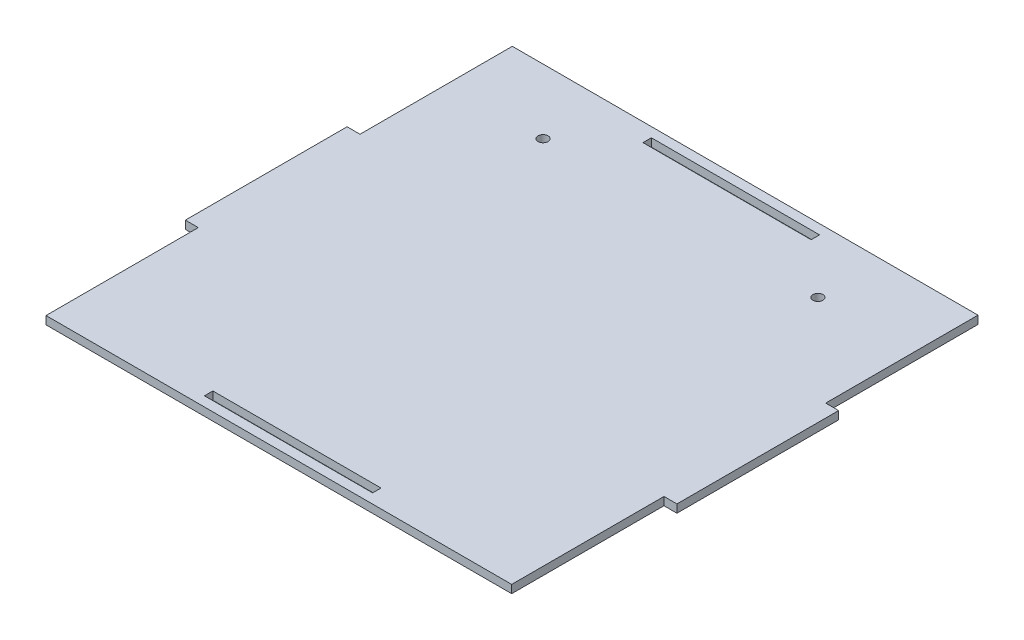
ISO-10303-21;
HEADER;
FILE_DESCRIPTION(('STEP AP214'),'2;1');
FILE_NAME('part.step','',(''),(''),'','','');
FILE_SCHEMA(('AUTOMOTIVE_DESIGN { 1 0 10303 214 1 1 1 1 }'));
ENDSEC;
DATA;
#1=APPLICATION_CONTEXT('core data for automotive mechanical design processes');
#2=APPLICATION_PROTOCOL_DEFINITION('international standard','automotive_design',2000,#1);
#3=PRODUCT_CONTEXT('',#1,'mechanical');
#4=PRODUCT('Part','Part','',(#3));
#5=PRODUCT_RELATED_PRODUCT_CATEGORY('part','',(#4));
#6=PRODUCT_DEFINITION_FORMATION('','',#4);
#7=PRODUCT_DEFINITION_CONTEXT('part definition',#1,'design');
#8=PRODUCT_DEFINITION('design','',#6,#7);
#9=PRODUCT_DEFINITION_SHAPE('','',#8);
#10=(LENGTH_UNIT() NAMED_UNIT(*) SI_UNIT(.MILLI.,.METRE.));
#11=(NAMED_UNIT(*) PLANE_ANGLE_UNIT() SI_UNIT($,.RADIAN.));
#12=(NAMED_UNIT(*) SI_UNIT($,.STERADIAN.) SOLID_ANGLE_UNIT());
#13=UNCERTAINTY_MEASURE_WITH_UNIT(LENGTH_MEASURE(1.E-05),#10,'distance_accuracy_value','');
#14=(GEOMETRIC_REPRESENTATION_CONTEXT(3) GLOBAL_UNCERTAINTY_ASSIGNED_CONTEXT((#13)) GLOBAL_UNIT_ASSIGNED_CONTEXT((#10,
#11,#12)) REPRESENTATION_CONTEXT('',''));
#15=CARTESIAN_POINT('',(0.,0.,0.));
#16=DIRECTION('',(0.,0.,1.));
#17=DIRECTION('',(1.,0.,0.));
#18=AXIS2_PLACEMENT_3D('',#15,#16,#17);
#19=CARTESIAN_POINT('',(0.,2.5,0.));
#20=DIRECTION('',(0.,-1.,0.));
#21=DIRECTION('',(0.,0.,-1.));
#22=AXIS2_PLACEMENT_3D('',#19,#20,#21);
#23=PLANE('',#22);
#24=CARTESIAN_POINT('',(42.5000000000001,2.5,-52.0999999999961));
#25=DIRECTION('',(0.,1.,0.));
#26=DIRECTION('',(0.,0.,1.));
#27=AXIS2_PLACEMENT_3D('',#24,#25,#26);
#28=CIRCLE('',#27,1.55);
#29=CARTESIAN_POINT('',(42.5000000000001,2.5,-50.5499999999961));
#30=VERTEX_POINT('',#29);
#31=EDGE_CURVE('E331',#30,#30,#28,.T.);
#32=ORIENTED_EDGE('',*,*,#31,.F.);
#33=EDGE_LOOP('',(#32));
#34=FACE_BOUND('',#33,.T.);
#35=DIRECTION('',(0.,0.,1.));
#36=VECTOR('',#35,1.);
#37=CARTESIAN_POINT('',(-25.9999999999999,2.5,-69.0999999999963));
#38=LINE('',#37,#36);
#39=CARTESIAN_POINT('',(-25.9999999999999,2.5,-69.0999999999963));
#40=VERTEX_POINT('',#39);
#41=CARTESIAN_POINT('',(-25.9999999999999,2.5,-66.4999999999963));
#42=VERTEX_POINT('',#41);
#43=EDGE_CURVE('E213',#40,#42,#38,.T.);
#44=ORIENTED_EDGE('',*,*,#43,.F.);
#45=DIRECTION('',(-1.,0.,0.));
#46=VECTOR('',#45,1.);
#47=CARTESIAN_POINT('',(-25.9999999999999,2.5,-69.0999999999963));
#48=LINE('',#47,#46);
#49=CARTESIAN_POINT('',(26.0000000000001,2.5,-69.0999999999963));
#50=VERTEX_POINT('',#49);
#51=EDGE_CURVE('E221',#50,#40,#48,.T.);
#52=ORIENTED_EDGE('',*,*,#51,.F.);
#53=DIRECTION('',(0.,0.,-1.));
#54=VECTOR('',#53,1.);
#55=CARTESIAN_POINT('',(26.0000000000001,2.5,-69.0999999999963));
#56=LINE('',#55,#54);
#57=CARTESIAN_POINT('',(26.0000000000001,2.5,-66.4999999999963));
#58=VERTEX_POINT('',#57);
#59=EDGE_CURVE('E218',#58,#50,#56,.T.);
#60=ORIENTED_EDGE('',*,*,#59,.F.);
#61=DIRECTION('',(1.,0.,0.));
#62=VECTOR('',#61,1.);
#63=CARTESIAN_POINT('',(-25.9999999999999,2.5,-66.4999999999963));
#64=LINE('',#63,#62);
#65=EDGE_CURVE('E215',#42,#58,#64,.T.);
#66=ORIENTED_EDGE('',*,*,#65,.F.);
#67=EDGE_LOOP('',(#44,#52,#60,#66));
#68=FACE_BOUND('',#67,.T.);
#69=DIRECTION('',(0.,0.,-1.));
#70=VECTOR('',#69,1.);
#71=CARTESIAN_POINT('',(72.0000000000003,2.5,72.099999999996));
#72=LINE('',#71,#70);
#73=CARTESIAN_POINT('',(72.0000000000003,2.5,72.099999999996));
#74=VERTEX_POINT('',#73);
#75=CARTESIAN_POINT('',(72.0000000000003,2.5,25.));
#76=VERTEX_POINT('',#75);
#77=EDGE_CURVE('E244',#74,#76,#72,.T.);
#78=ORIENTED_EDGE('',*,*,#77,.T.);
#79=DIRECTION('',(1.,0.,0.));
#80=VECTOR('',#79,1.);
#81=CARTESIAN_POINT('',(72.0000000000003,2.5,25.));
#82=LINE('',#81,#80);
#83=CARTESIAN_POINT('',(76.0000000000001,2.5,25.));
#84=VERTEX_POINT('',#83);
#85=EDGE_CURVE('E247',#76,#84,#82,.T.);
#86=ORIENTED_EDGE('',*,*,#85,.T.);
#87=DIRECTION('',(0.,0.,-1.));
#88=VECTOR('',#87,1.);
#89=CARTESIAN_POINT('',(76.0000000000001,2.5,25.));
#90=LINE('',#89,#88);
#91=CARTESIAN_POINT('',(76.0000000000001,2.5,-25.));
#92=VERTEX_POINT('',#91);
#93=EDGE_CURVE('E250',#84,#92,#90,.T.);
#94=ORIENTED_EDGE('',*,*,#93,.T.);
#95=DIRECTION('',(-1.,0.,0.));
#96=VECTOR('',#95,1.);
#97=CARTESIAN_POINT('',(76.0000000000001,2.5,-25.));
#98=LINE('',#97,#96);
#99=CARTESIAN_POINT('',(72.0000000000001,2.5,-25.));
#100=VERTEX_POINT('',#99);
#101=EDGE_CURVE('E252',#92,#100,#98,.T.);
#102=ORIENTED_EDGE('',*,*,#101,.T.);
#103=DIRECTION('',(0.,0.,-1.));
#104=VECTOR('',#103,1.);
#105=CARTESIAN_POINT('',(72.0000000000001,2.5,-25.));
#106=LINE('',#105,#104);
#107=CARTESIAN_POINT('',(72.0000000000001,2.5,-72.0999999999961));
#108=VERTEX_POINT('',#107);
#109=EDGE_CURVE('E254',#100,#108,#106,.T.);
#110=ORIENTED_EDGE('',*,*,#109,.T.);
#111=DIRECTION('',(-1.,0.,0.));
#112=VECTOR('',#111,1.);
#113=CARTESIAN_POINT('',(72.0000000000001,2.5,-72.0999999999961));
#114=LINE('',#113,#112);
#115=CARTESIAN_POINT('',(-71.9999999999999,2.5,-72.0999999999961));
#116=VERTEX_POINT('',#115);
#117=EDGE_CURVE('E256',#108,#116,#114,.T.);
#118=ORIENTED_EDGE('',*,*,#117,.T.);
#119=DIRECTION('',(0.,0.,1.));
#120=VECTOR('',#119,1.);
#121=CARTESIAN_POINT('',(-71.9999999999999,2.5,-72.0999999999961));
#122=LINE('',#121,#120);
#123=CARTESIAN_POINT('',(-71.9999999999997,2.5,-25.));
#124=VERTEX_POINT('',#123);
#125=EDGE_CURVE('E258',#116,#124,#122,.T.);
#126=ORIENTED_EDGE('',*,*,#125,.T.);
#127=DIRECTION('',(-1.,0.,0.));
#128=VECTOR('',#127,1.);
#129=CARTESIAN_POINT('',(-71.9999999999997,2.5,-25.));
#130=LINE('',#129,#128);
#131=CARTESIAN_POINT('',(-76.,2.5,-25.));
#132=VERTEX_POINT('',#131);
#133=EDGE_CURVE('E260',#124,#132,#130,.T.);
#134=ORIENTED_EDGE('',*,*,#133,.T.);
#135=DIRECTION('',(0.,0.,1.));
#136=VECTOR('',#135,1.);
#137=CARTESIAN_POINT('',(-76.,2.5,-25.));
#138=LINE('',#137,#136);
#139=CARTESIAN_POINT('',(-75.9999999999998,2.5,25.));
#140=VERTEX_POINT('',#139);
#141=EDGE_CURVE('E262',#132,#140,#138,.T.);
#142=ORIENTED_EDGE('',*,*,#141,.T.);
#143=DIRECTION('',(1.,0.,0.));
#144=VECTOR('',#143,1.);
#145=CARTESIAN_POINT('',(-75.9999999999998,2.5,25.));
#146=LINE('',#145,#144);
#147=CARTESIAN_POINT('',(-71.9999999999998,2.5,25.));
#148=VERTEX_POINT('',#147);
#149=EDGE_CURVE('E264',#140,#148,#146,.T.);
#150=ORIENTED_EDGE('',*,*,#149,.T.);
#151=DIRECTION('',(0.,0.,1.));
#152=VECTOR('',#151,1.);
#153=CARTESIAN_POINT('',(-71.9999999999998,2.5,25.));
#154=LINE('',#153,#152);
#155=CARTESIAN_POINT('',(-71.9999999999998,2.5,72.0999999999961));
#156=VERTEX_POINT('',#155);
#157=EDGE_CURVE('E266',#148,#156,#154,.T.);
#158=ORIENTED_EDGE('',*,*,#157,.T.);
#159=DIRECTION('',(1.,0.,0.));
#160=VECTOR('',#159,1.);
#161=CARTESIAN_POINT('',(-71.9999999999998,2.5,72.0999999999961));
#162=LINE('',#161,#160);
#163=EDGE_CURVE('E268',#156,#74,#162,.T.);
#164=ORIENTED_EDGE('',*,*,#163,.T.);
#165=EDGE_LOOP('',(#78,#86,#94,#102,#110,#118,#126,#134,#142,#150,#158,#164));
#166=FACE_BOUND('',#165,.T.);
#167=DIRECTION('',(1.,0.,0.));
#168=VECTOR('',#167,1.);
#169=CARTESIAN_POINT('',(-25.9999999999999,2.5,69.0999999999963));
#170=LINE('',#169,#168);
#171=CARTESIAN_POINT('',(-25.9999999999999,2.5,69.0999999999963));
#172=VERTEX_POINT('',#171);
#173=CARTESIAN_POINT('',(26.0000000000001,2.5,69.0999999999963));
#174=VERTEX_POINT('',#173);
#175=EDGE_CURVE('E175',#172,#174,#170,.T.);
#176=ORIENTED_EDGE('',*,*,#175,.F.);
#177=DIRECTION('',(0.,0.,1.));
#178=VECTOR('',#177,1.);
#179=CARTESIAN_POINT('',(-25.9999999999999,2.5,69.0999999999963));
#180=LINE('',#179,#178);
#181=CARTESIAN_POINT('',(-25.9999999999999,2.5,66.4999999999963));
#182=VERTEX_POINT('',#181);
#183=EDGE_CURVE('E198',#182,#172,#180,.T.);
#184=ORIENTED_EDGE('',*,*,#183,.F.);
#185=DIRECTION('',(-1.,0.,0.));
#186=VECTOR('',#185,1.);
#187=CARTESIAN_POINT('',(-25.9999999999999,2.5,66.4999999999963));
#188=LINE('',#187,#186);
#189=CARTESIAN_POINT('',(26.0000000000001,2.5,66.4999999999963));
#190=VERTEX_POINT('',#189);
#191=EDGE_CURVE('E196',#190,#182,#188,.T.);
#192=ORIENTED_EDGE('',*,*,#191,.F.);
#193=DIRECTION('',(0.,0.,-1.));
#194=VECTOR('',#193,1.);
#195=CARTESIAN_POINT('',(26.0000000000001,2.5,69.0999999999963));
#196=LINE('',#195,#194);
#197=EDGE_CURVE('E183',#174,#190,#196,.T.);
#198=ORIENTED_EDGE('',*,*,#197,.F.);
#199=EDGE_LOOP('',(#176,#184,#192,#198));
#200=FACE_BOUND('',#199,.T.);
#201=CARTESIAN_POINT('',(-42.5000000000001,2.5,-52.0999999999961));
#202=DIRECTION('',(0.,1.,0.));
#203=DIRECTION('',(0.,0.,1.));
#204=AXIS2_PLACEMENT_3D('',#201,#202,#203);
#205=CIRCLE('',#204,1.55);
#206=CARTESIAN_POINT('',(-42.5000000000001,2.5,-50.5499999999961));
#207=VERTEX_POINT('',#206);
#208=EDGE_CURVE('E326',#207,#207,#205,.F.);
#209=ORIENTED_EDGE('',*,*,#208,.T.);
#210=EDGE_LOOP('',(#209));
#211=FACE_BOUND('',#210,.T.);
#212=ADVANCED_FACE('F36',(#34,#68,#166,#200,#211),#23,.F.);
#213=CARTESIAN_POINT('',(0.,0.,0.));
#214=DIRECTION('',(0.,-1.,0.));
#215=DIRECTION('',(0.,0.,-1.));
#216=AXIS2_PLACEMENT_3D('',#213,#214,#215);
#217=PLANE('',#216);
#218=DIRECTION('',(0.,0.,1.));
#219=VECTOR('',#218,1.);
#220=CARTESIAN_POINT('',(-25.9999999999999,0.,69.0999999999963));
#221=LINE('',#220,#219);
#222=CARTESIAN_POINT('',(-25.9999999999999,0.,66.4999999999963));
#223=VERTEX_POINT('',#222);
#224=CARTESIAN_POINT('',(-25.9999999999999,0.,69.0999999999963));
#225=VERTEX_POINT('',#224);
#226=EDGE_CURVE('E184',#223,#225,#221,.T.);
#227=ORIENTED_EDGE('',*,*,#226,.T.);
#228=DIRECTION('',(1.,0.,0.));
#229=VECTOR('',#228,1.);
#230=CARTESIAN_POINT('',(-25.9999999999999,0.,69.0999999999963));
#231=LINE('',#230,#229);
#232=CARTESIAN_POINT('',(26.0000000000001,0.,69.0999999999963));
#233=VERTEX_POINT('',#232);
#234=EDGE_CURVE('E61',#225,#233,#231,.T.);
#235=ORIENTED_EDGE('',*,*,#234,.T.);
#236=DIRECTION('',(0.,0.,-1.));
#237=VECTOR('',#236,1.);
#238=CARTESIAN_POINT('',(26.0000000000001,0.,69.0999999999963));
#239=LINE('',#238,#237);
#240=CARTESIAN_POINT('',(26.0000000000001,0.,66.4999999999963));
#241=VERTEX_POINT('',#240);
#242=EDGE_CURVE('E190',#233,#241,#239,.T.);
#243=ORIENTED_EDGE('',*,*,#242,.T.);
#244=DIRECTION('',(-1.,0.,0.));
#245=VECTOR('',#244,1.);
#246=CARTESIAN_POINT('',(-25.9999999999999,0.,66.4999999999963));
#247=LINE('',#246,#245);
#248=EDGE_CURVE('E205',#241,#223,#247,.T.);
#249=ORIENTED_EDGE('',*,*,#248,.T.);
#250=EDGE_LOOP('',(#227,#235,#243,#249));
#251=FACE_BOUND('',#250,.T.);
#252=DIRECTION('',(-1.,0.,0.));
#253=VECTOR('',#252,1.);
#254=CARTESIAN_POINT('',(-25.9999999999999,0.,-69.0999999999963));
#255=LINE('',#254,#253);
#256=CARTESIAN_POINT('',(26.0000000000001,0.,-69.0999999999963));
#257=VERTEX_POINT('',#256);
#258=CARTESIAN_POINT('',(-25.9999999999999,0.,-69.0999999999963));
#259=VERTEX_POINT('',#258);
#260=EDGE_CURVE('E216',#257,#259,#255,.T.);
#261=ORIENTED_EDGE('',*,*,#260,.T.);
#262=DIRECTION('',(0.,0.,1.));
#263=VECTOR('',#262,1.);
#264=CARTESIAN_POINT('',(-25.9999999999999,0.,-69.0999999999963));
#265=LINE('',#264,#263);
#266=CARTESIAN_POINT('',(-25.9999999999999,0.,-66.4999999999963));
#267=VERTEX_POINT('',#266);
#268=EDGE_CURVE('E191',#259,#267,#265,.T.);
#269=ORIENTED_EDGE('',*,*,#268,.T.);
#270=DIRECTION('',(1.,0.,0.));
#271=VECTOR('',#270,1.);
#272=CARTESIAN_POINT('',(-25.9999999999999,0.,-66.4999999999963));
#273=LINE('',#272,#271);
#274=CARTESIAN_POINT('',(26.0000000000001,0.,-66.4999999999963));
#275=VERTEX_POINT('',#274);
#276=EDGE_CURVE('E226',#267,#275,#273,.T.);
#277=ORIENTED_EDGE('',*,*,#276,.T.);
#278=DIRECTION('',(0.,0.,-1.));
#279=VECTOR('',#278,1.);
#280=CARTESIAN_POINT('',(26.0000000000001,0.,-69.0999999999963));
#281=LINE('',#280,#279);
#282=EDGE_CURVE('E229',#275,#257,#281,.T.);
#283=ORIENTED_EDGE('',*,*,#282,.T.);
#284=EDGE_LOOP('',(#261,#269,#277,#283));
#285=FACE_BOUND('',#284,.T.);
#286=DIRECTION('',(0.,0.,-1.));
#287=VECTOR('',#286,1.);
#288=CARTESIAN_POINT('',(72.0000000000003,0.,72.099999999996));
#289=LINE('',#288,#287);
#290=CARTESIAN_POINT('',(72.0000000000003,0.,72.099999999996));
#291=VERTEX_POINT('',#290);
#292=CARTESIAN_POINT('',(72.0000000000003,0.,25.));
#293=VERTEX_POINT('',#292);
#294=EDGE_CURVE('E243',#291,#293,#289,.T.);
#295=ORIENTED_EDGE('',*,*,#294,.F.);
#296=DIRECTION('',(1.,0.,0.));
#297=VECTOR('',#296,1.);
#298=CARTESIAN_POINT('',(-71.9999999999998,0.,72.0999999999961));
#299=LINE('',#298,#297);
#300=CARTESIAN_POINT('',(-71.9999999999998,0.,72.0999999999961));
#301=VERTEX_POINT('',#300);
#302=EDGE_CURVE('E248',#301,#291,#299,.T.);
#303=ORIENTED_EDGE('',*,*,#302,.F.);
#304=DIRECTION('',(0.,0.,1.));
#305=VECTOR('',#304,1.);
#306=CARTESIAN_POINT('',(-71.9999999999998,0.,25.));
#307=LINE('',#306,#305);
#308=CARTESIAN_POINT('',(-71.9999999999998,0.,25.));
#309=VERTEX_POINT('',#308);
#310=EDGE_CURVE('E291',#309,#301,#307,.T.);
#311=ORIENTED_EDGE('',*,*,#310,.F.);
#312=DIRECTION('',(1.,0.,0.));
#313=VECTOR('',#312,1.);
#314=CARTESIAN_POINT('',(-75.9999999999998,0.,25.));
#315=LINE('',#314,#313);
#316=CARTESIAN_POINT('',(-75.9999999999998,0.,25.));
#317=VERTEX_POINT('',#316);
#318=EDGE_CURVE('E289',#317,#309,#315,.T.);
#319=ORIENTED_EDGE('',*,*,#318,.F.);
#320=DIRECTION('',(0.,0.,1.));
#321=VECTOR('',#320,1.);
#322=CARTESIAN_POINT('',(-76.,0.,-25.));
#323=LINE('',#322,#321);
#324=CARTESIAN_POINT('',(-76.,0.,-25.));
#325=VERTEX_POINT('',#324);
#326=EDGE_CURVE('E287',#325,#317,#323,.T.);
#327=ORIENTED_EDGE('',*,*,#326,.F.);
#328=DIRECTION('',(-1.,0.,0.));
#329=VECTOR('',#328,1.);
#330=CARTESIAN_POINT('',(-71.9999999999997,0.,-25.));
#331=LINE('',#330,#329);
#332=CARTESIAN_POINT('',(-71.9999999999997,0.,-25.));
#333=VERTEX_POINT('',#332);
#334=EDGE_CURVE('E285',#333,#325,#331,.T.);
#335=ORIENTED_EDGE('',*,*,#334,.F.);
#336=DIRECTION('',(0.,0.,1.));
#337=VECTOR('',#336,1.);
#338=CARTESIAN_POINT('',(-71.9999999999999,0.,-72.0999999999961));
#339=LINE('',#338,#337);
#340=CARTESIAN_POINT('',(-71.9999999999999,0.,-72.0999999999961));
#341=VERTEX_POINT('',#340);
#342=EDGE_CURVE('E283',#341,#333,#339,.T.);
#343=ORIENTED_EDGE('',*,*,#342,.F.);
#344=DIRECTION('',(-1.,0.,0.));
#345=VECTOR('',#344,1.);
#346=CARTESIAN_POINT('',(72.0000000000001,0.,-72.0999999999961));
#347=LINE('',#346,#345);
#348=CARTESIAN_POINT('',(72.0000000000001,0.,-72.0999999999961));
#349=VERTEX_POINT('',#348);
#350=EDGE_CURVE('E281',#349,#341,#347,.T.);
#351=ORIENTED_EDGE('',*,*,#350,.F.);
#352=DIRECTION('',(0.,0.,-1.));
#353=VECTOR('',#352,1.);
#354=CARTESIAN_POINT('',(72.0000000000001,0.,-25.));
#355=LINE('',#354,#353);
#356=CARTESIAN_POINT('',(72.0000000000001,0.,-25.));
#357=VERTEX_POINT('',#356);
#358=EDGE_CURVE('E279',#357,#349,#355,.T.);
#359=ORIENTED_EDGE('',*,*,#358,.F.);
#360=DIRECTION('',(-1.,0.,0.));
#361=VECTOR('',#360,1.);
#362=CARTESIAN_POINT('',(76.0000000000001,0.,-25.));
#363=LINE('',#362,#361);
#364=CARTESIAN_POINT('',(76.0000000000001,0.,-25.));
#365=VERTEX_POINT('',#364);
#366=EDGE_CURVE('E277',#365,#357,#363,.T.);
#367=ORIENTED_EDGE('',*,*,#366,.F.);
#368=DIRECTION('',(0.,0.,-1.));
#369=VECTOR('',#368,1.);
#370=CARTESIAN_POINT('',(76.0000000000001,0.,25.));
#371=LINE('',#370,#369);
#372=CARTESIAN_POINT('',(76.0000000000001,0.,25.));
#373=VERTEX_POINT('',#372);
#374=EDGE_CURVE('E275',#373,#365,#371,.T.);
#375=ORIENTED_EDGE('',*,*,#374,.F.);
#376=DIRECTION('',(1.,0.,0.));
#377=VECTOR('',#376,1.);
#378=CARTESIAN_POINT('',(72.0000000000003,0.,25.));
#379=LINE('',#378,#377);
#380=EDGE_CURVE('E273',#293,#373,#379,.T.);
#381=ORIENTED_EDGE('',*,*,#380,.F.);
#382=EDGE_LOOP('',(#295,#303,#311,#319,#327,#335,#343,#351,#359,#367,#375,#381));
#383=FACE_BOUND('',#382,.T.);
#384=CARTESIAN_POINT('',(42.5000000000001,0.,-52.0999999999961));
#385=DIRECTION('',(0.,-1.,0.));
#386=DIRECTION('',(0.,0.,-1.));
#387=AXIS2_PLACEMENT_3D('',#384,#385,#386);
#388=CIRCLE('',#387,1.55);
#389=CARTESIAN_POINT('',(42.5000000000001,0.,-53.6499999999961));
#390=VERTEX_POINT('',#389);
#391=EDGE_CURVE('E324',#390,#390,#388,.T.);
#392=ORIENTED_EDGE('',*,*,#391,.F.);
#393=EDGE_LOOP('',(#392));
#394=FACE_BOUND('',#393,.T.);
#395=CARTESIAN_POINT('',(-42.5000000000001,0.,-52.0999999999961));
#396=DIRECTION('',(0.,-1.,0.));
#397=DIRECTION('',(0.,0.,-1.));
#398=AXIS2_PLACEMENT_3D('',#395,#396,#397);
#399=CIRCLE('',#398,1.55);
#400=CARTESIAN_POINT('',(-42.5000000000001,0.,-53.6499999999961));
#401=VERTEX_POINT('',#400);
#402=EDGE_CURVE('E40',#401,#401,#399,.F.);
#403=ORIENTED_EDGE('',*,*,#402,.T.);
#404=EDGE_LOOP('',(#403));
#405=FACE_BOUND('',#404,.T.);
#406=ADVANCED_FACE('F341',(#251,#285,#383,#394,#405),#217,.T.);
#407=CARTESIAN_POINT('',(72.0000000000003,2.5,72.099999999996));
#408=DIRECTION('',(-1.,0.,0.));
#409=DIRECTION('',(0.,0.,1.));
#410=AXIS2_PLACEMENT_3D('',#407,#408,#409);
#411=PLANE('',#410);
#412=ORIENTED_EDGE('',*,*,#294,.T.);
#413=DIRECTION('',(0.,-1.,0.));
#414=VECTOR('',#413,1.);
#415=CARTESIAN_POINT('',(72.0000000000003,2.5,25.));
#416=LINE('',#415,#414);
#417=EDGE_CURVE('E11',#76,#293,#416,.T.);
#418=ORIENTED_EDGE('',*,*,#417,.F.);
#419=ORIENTED_EDGE('',*,*,#77,.F.);
#420=DIRECTION('',(0.,-1.,0.));
#421=VECTOR('',#420,1.);
#422=CARTESIAN_POINT('',(72.0000000000003,2.5,72.099999999996));
#423=LINE('',#422,#421);
#424=EDGE_CURVE('E270',#74,#291,#423,.T.);
#425=ORIENTED_EDGE('',*,*,#424,.T.);
#426=EDGE_LOOP('',(#412,#418,#419,#425));
#427=FACE_BOUND('',#426,.T.);
#428=ADVANCED_FACE('F38',(#427),#411,.F.);
#429=CARTESIAN_POINT('',(72.0000000000003,2.5,25.));
#430=DIRECTION('',(0.,0.,-1.));
#431=DIRECTION('',(-1.,0.,0.));
#432=AXIS2_PLACEMENT_3D('',#429,#430,#431);
#433=PLANE('',#432);
#434=ORIENTED_EDGE('',*,*,#380,.T.);
#435=DIRECTION('',(0.,-1.,0.));
#436=VECTOR('',#435,1.);
#437=CARTESIAN_POINT('',(76.0000000000001,2.5,25.));
#438=LINE('',#437,#436);
#439=EDGE_CURVE('E45',#84,#373,#438,.T.);
#440=ORIENTED_EDGE('',*,*,#439,.F.);
#441=ORIENTED_EDGE('',*,*,#85,.F.);
#442=ORIENTED_EDGE('',*,*,#417,.T.);
#443=EDGE_LOOP('',(#434,#440,#441,#442));
#444=FACE_BOUND('',#443,.T.);
#445=ADVANCED_FACE('F355',(#444),#433,.F.);
#446=CARTESIAN_POINT('',(76.0000000000001,2.5,25.));
#447=DIRECTION('',(-1.,0.,0.));
#448=DIRECTION('',(0.,0.,1.));
#449=AXIS2_PLACEMENT_3D('',#446,#447,#448);
#450=PLANE('',#449);
#451=ORIENTED_EDGE('',*,*,#374,.T.);
#452=DIRECTION('',(0.,-1.,0.));
#453=VECTOR('',#452,1.);
#454=CARTESIAN_POINT('',(76.0000000000001,2.5,-25.));
#455=LINE('',#454,#453);
#456=EDGE_CURVE('E320',#92,#365,#455,.T.);
#457=ORIENTED_EDGE('',*,*,#456,.F.);
#458=ORIENTED_EDGE('',*,*,#93,.F.);
#459=ORIENTED_EDGE('',*,*,#439,.T.);
#460=EDGE_LOOP('',(#451,#457,#458,#459));
#461=FACE_BOUND('',#460,.T.);
#462=ADVANCED_FACE('F360',(#461),#450,.F.);
#463=CARTESIAN_POINT('',(76.0000000000001,2.5,-25.));
#464=DIRECTION('',(0.,0.,1.));
#465=DIRECTION('',(1.,0.,0.));
#466=AXIS2_PLACEMENT_3D('',#463,#464,#465);
#467=PLANE('',#466);
#468=ORIENTED_EDGE('',*,*,#366,.T.);
#469=DIRECTION('',(0.,-1.,0.));
#470=VECTOR('',#469,1.);
#471=CARTESIAN_POINT('',(72.0000000000001,2.5,-25.));
#472=LINE('',#471,#470);
#473=EDGE_CURVE('E317',#100,#357,#472,.T.);
#474=ORIENTED_EDGE('',*,*,#473,.F.);
#475=ORIENTED_EDGE('',*,*,#101,.F.);
#476=ORIENTED_EDGE('',*,*,#456,.T.);
#477=EDGE_LOOP('',(#468,#474,#475,#476));
#478=FACE_BOUND('',#477,.T.);
#479=ADVANCED_FACE('F366',(#478),#467,.F.);
#480=CARTESIAN_POINT('',(72.0000000000001,2.5,-25.));
#481=DIRECTION('',(-1.,0.,0.));
#482=DIRECTION('',(0.,0.,1.));
#483=AXIS2_PLACEMENT_3D('',#480,#481,#482);
#484=PLANE('',#483);
#485=ORIENTED_EDGE('',*,*,#358,.T.);
#486=DIRECTION('',(0.,-1.,0.));
#487=VECTOR('',#486,1.);
#488=CARTESIAN_POINT('',(72.0000000000001,2.5,-72.0999999999961));
#489=LINE('',#488,#487);
#490=EDGE_CURVE('E314',#108,#349,#489,.T.);
#491=ORIENTED_EDGE('',*,*,#490,.F.);
#492=ORIENTED_EDGE('',*,*,#109,.F.);
#493=ORIENTED_EDGE('',*,*,#473,.T.);
#494=EDGE_LOOP('',(#485,#491,#492,#493));
#495=FACE_BOUND('',#494,.T.);
#496=ADVANCED_FACE('F370',(#495),#484,.F.);
#497=CARTESIAN_POINT('',(72.0000000000001,2.5,-72.0999999999961));
#498=DIRECTION('',(0.,0.,1.));
#499=DIRECTION('',(1.,0.,0.));
#500=AXIS2_PLACEMENT_3D('',#497,#498,#499);
#501=PLANE('',#500);
#502=ORIENTED_EDGE('',*,*,#350,.T.);
#503=DIRECTION('',(0.,-1.,0.));
#504=VECTOR('',#503,1.);
#505=CARTESIAN_POINT('',(-71.9999999999999,2.5,-72.0999999999961));
#506=LINE('',#505,#504);
#507=EDGE_CURVE('E311',#116,#341,#506,.T.);
#508=ORIENTED_EDGE('',*,*,#507,.F.);
#509=ORIENTED_EDGE('',*,*,#117,.F.);
#510=ORIENTED_EDGE('',*,*,#490,.T.);
#511=EDGE_LOOP('',(#502,#508,#509,#510));
#512=FACE_BOUND('',#511,.T.);
#513=ADVANCED_FACE('F375',(#512),#501,.F.);
#514=CARTESIAN_POINT('',(-71.9999999999999,2.5,-72.0999999999961));
#515=DIRECTION('',(1.,0.,0.));
#516=DIRECTION('',(0.,0.,-1.));
#517=AXIS2_PLACEMENT_3D('',#514,#515,#516);
#518=PLANE('',#517);
#519=ORIENTED_EDGE('',*,*,#342,.T.);
#520=DIRECTION('',(0.,-1.,0.));
#521=VECTOR('',#520,1.);
#522=CARTESIAN_POINT('',(-71.9999999999997,2.5,-25.));
#523=LINE('',#522,#521);
#524=EDGE_CURVE('E308',#124,#333,#523,.T.);
#525=ORIENTED_EDGE('',*,*,#524,.F.);
#526=ORIENTED_EDGE('',*,*,#125,.F.);
#527=ORIENTED_EDGE('',*,*,#507,.T.);
#528=EDGE_LOOP('',(#519,#525,#526,#527));
#529=FACE_BOUND('',#528,.T.);
#530=ADVANCED_FACE('F381',(#529),#518,.F.);
#531=CARTESIAN_POINT('',(-71.9999999999997,2.5,-25.));
#532=DIRECTION('',(0.,0.,1.));
#533=DIRECTION('',(1.,0.,0.));
#534=AXIS2_PLACEMENT_3D('',#531,#532,#533);
#535=PLANE('',#534);
#536=ORIENTED_EDGE('',*,*,#334,.T.);
#537=DIRECTION('',(0.,-1.,0.));
#538=VECTOR('',#537,1.);
#539=CARTESIAN_POINT('',(-76.,2.5,-25.));
#540=LINE('',#539,#538);
#541=EDGE_CURVE('E305',#132,#325,#540,.T.);
#542=ORIENTED_EDGE('',*,*,#541,.F.);
#543=ORIENTED_EDGE('',*,*,#133,.F.);
#544=ORIENTED_EDGE('',*,*,#524,.T.);
#545=EDGE_LOOP('',(#536,#542,#543,#544));
#546=FACE_BOUND('',#545,.T.);
#547=ADVANCED_FACE('F385',(#546),#535,.F.);
#548=CARTESIAN_POINT('',(-76.,2.5,-25.));
#549=DIRECTION('',(1.,0.,0.));
#550=DIRECTION('',(0.,0.,-1.));
#551=AXIS2_PLACEMENT_3D('',#548,#549,#550);
#552=PLANE('',#551);
#553=ORIENTED_EDGE('',*,*,#326,.T.);
#554=DIRECTION('',(0.,-1.,0.));
#555=VECTOR('',#554,1.);
#556=CARTESIAN_POINT('',(-75.9999999999998,2.5,25.));
#557=LINE('',#556,#555);
#558=EDGE_CURVE('E302',#140,#317,#557,.T.);
#559=ORIENTED_EDGE('',*,*,#558,.F.);
#560=ORIENTED_EDGE('',*,*,#141,.F.);
#561=ORIENTED_EDGE('',*,*,#541,.T.);
#562=EDGE_LOOP('',(#553,#559,#560,#561));
#563=FACE_BOUND('',#562,.T.);
#564=ADVANCED_FACE('F390',(#563),#552,.F.);
#565=CARTESIAN_POINT('',(-75.9999999999998,2.5,25.));
#566=DIRECTION('',(0.,0.,-1.));
#567=DIRECTION('',(-1.,0.,0.));
#568=AXIS2_PLACEMENT_3D('',#565,#566,#567);
#569=PLANE('',#568);
#570=ORIENTED_EDGE('',*,*,#318,.T.);
#571=DIRECTION('',(0.,-1.,0.));
#572=VECTOR('',#571,1.);
#573=CARTESIAN_POINT('',(-71.9999999999998,2.5,25.));
#574=LINE('',#573,#572);
#575=EDGE_CURVE('E299',#148,#309,#574,.T.);
#576=ORIENTED_EDGE('',*,*,#575,.F.);
#577=ORIENTED_EDGE('',*,*,#149,.F.);
#578=ORIENTED_EDGE('',*,*,#558,.T.);
#579=EDGE_LOOP('',(#570,#576,#577,#578));
#580=FACE_BOUND('',#579,.T.);
#581=ADVANCED_FACE('F396',(#580),#569,.F.);
#582=CARTESIAN_POINT('',(-71.9999999999998,2.5,25.));
#583=DIRECTION('',(1.,0.,0.));
#584=DIRECTION('',(0.,0.,-1.));
#585=AXIS2_PLACEMENT_3D('',#582,#583,#584);
#586=PLANE('',#585);
#587=ORIENTED_EDGE('',*,*,#310,.T.);
#588=DIRECTION('',(0.,-1.,0.));
#589=VECTOR('',#588,1.);
#590=CARTESIAN_POINT('',(-71.9999999999998,2.5,72.0999999999961));
#591=LINE('',#590,#589);
#592=EDGE_CURVE('E296',#156,#301,#591,.T.);
#593=ORIENTED_EDGE('',*,*,#592,.F.);
#594=ORIENTED_EDGE('',*,*,#157,.F.);
#595=ORIENTED_EDGE('',*,*,#575,.T.);
#596=EDGE_LOOP('',(#587,#593,#594,#595));
#597=FACE_BOUND('',#596,.T.);
#598=ADVANCED_FACE('F400',(#597),#586,.F.);
#599=CARTESIAN_POINT('',(-71.9999999999998,2.5,72.0999999999961));
#600=DIRECTION('',(0.,0.,-1.));
#601=DIRECTION('',(-1.,0.,0.));
#602=AXIS2_PLACEMENT_3D('',#599,#600,#601);
#603=PLANE('',#602);
#604=ORIENTED_EDGE('',*,*,#302,.T.);
#605=ORIENTED_EDGE('',*,*,#424,.F.);
#606=ORIENTED_EDGE('',*,*,#163,.F.);
#607=ORIENTED_EDGE('',*,*,#592,.T.);
#608=EDGE_LOOP('',(#604,#605,#606,#607));
#609=FACE_BOUND('',#608,.T.);
#610=ADVANCED_FACE('F403',(#609),#603,.F.);
#611=CARTESIAN_POINT('',(-25.9999999999999,2.5,-69.0999999999963));
#612=DIRECTION('',(1.,0.,0.));
#613=DIRECTION('',(0.,0.,-1.));
#614=AXIS2_PLACEMENT_3D('',#611,#612,#613);
#615=PLANE('',#614);
#616=ORIENTED_EDGE('',*,*,#268,.F.);
#617=DIRECTION('',(0.,-1.,0.));
#618=VECTOR('',#617,1.);
#619=CARTESIAN_POINT('',(-25.9999999999999,2.5,-69.0999999999963));
#620=LINE('',#619,#618);
#621=EDGE_CURVE('E223',#40,#259,#620,.T.);
#622=ORIENTED_EDGE('',*,*,#621,.F.);
#623=ORIENTED_EDGE('',*,*,#43,.T.);
#624=DIRECTION('',(0.,-1.,0.));
#625=VECTOR('',#624,1.);
#626=CARTESIAN_POINT('',(-25.9999999999999,2.5,-66.4999999999963));
#627=LINE('',#626,#625);
#628=EDGE_CURVE('E240',#42,#267,#627,.T.);
#629=ORIENTED_EDGE('',*,*,#628,.T.);
#630=EDGE_LOOP('',(#616,#622,#623,#629));
#631=FACE_BOUND('',#630,.T.);
#632=ADVANCED_FACE('F443',(#631),#615,.T.);
#633=CARTESIAN_POINT('',(-25.9999999999999,2.5,-66.4999999999963));
#634=DIRECTION('',(0.,0.,-1.));
#635=DIRECTION('',(-1.,0.,0.));
#636=AXIS2_PLACEMENT_3D('',#633,#634,#635);
#637=PLANE('',#636);
#638=ORIENTED_EDGE('',*,*,#276,.F.);
#639=ORIENTED_EDGE('',*,*,#628,.F.);
#640=ORIENTED_EDGE('',*,*,#65,.T.);
#641=DIRECTION('',(0.,-1.,0.));
#642=VECTOR('',#641,1.);
#643=CARTESIAN_POINT('',(26.0000000000001,2.5,-66.4999999999963));
#644=LINE('',#643,#642);
#645=EDGE_CURVE('E238',#58,#275,#644,.T.);
#646=ORIENTED_EDGE('',*,*,#645,.T.);
#647=EDGE_LOOP('',(#638,#639,#640,#646));
#648=FACE_BOUND('',#647,.T.);
#649=ADVANCED_FACE('F439',(#648),#637,.T.);
#650=CARTESIAN_POINT('',(26.0000000000001,2.5,-69.0999999999963));
#651=DIRECTION('',(-1.,0.,0.));
#652=DIRECTION('',(0.,0.,1.));
#653=AXIS2_PLACEMENT_3D('',#650,#651,#652);
#654=PLANE('',#653);
#655=ORIENTED_EDGE('',*,*,#282,.F.);
#656=ORIENTED_EDGE('',*,*,#645,.F.);
#657=ORIENTED_EDGE('',*,*,#59,.T.);
#658=DIRECTION('',(0.,-1.,0.));
#659=VECTOR('',#658,1.);
#660=CARTESIAN_POINT('',(26.0000000000001,2.5,-69.0999999999963));
#661=LINE('',#660,#659);
#662=EDGE_CURVE('E236',#50,#257,#661,.T.);
#663=ORIENTED_EDGE('',*,*,#662,.T.);
#664=EDGE_LOOP('',(#655,#656,#657,#663));
#665=FACE_BOUND('',#664,.T.);
#666=ADVANCED_FACE('F435',(#665),#654,.T.);
#667=CARTESIAN_POINT('',(-25.9999999999999,2.5,-69.0999999999963));
#668=DIRECTION('',(0.,0.,1.));
#669=DIRECTION('',(1.,0.,0.));
#670=AXIS2_PLACEMENT_3D('',#667,#668,#669);
#671=PLANE('',#670);
#672=ORIENTED_EDGE('',*,*,#260,.F.);
#673=ORIENTED_EDGE('',*,*,#662,.F.);
#674=ORIENTED_EDGE('',*,*,#51,.T.);
#675=ORIENTED_EDGE('',*,*,#621,.T.);
#676=EDGE_LOOP('',(#672,#673,#674,#675));
#677=FACE_BOUND('',#676,.T.);
#678=ADVANCED_FACE('F432',(#677),#671,.T.);
#679=CARTESIAN_POINT('',(-25.9999999999999,2.5,69.0999999999963));
#680=DIRECTION('',(0.,0.,-1.));
#681=DIRECTION('',(-1.,0.,0.));
#682=AXIS2_PLACEMENT_3D('',#679,#680,#681);
#683=PLANE('',#682);
#684=ORIENTED_EDGE('',*,*,#234,.F.);
#685=DIRECTION('',(0.,-1.,0.));
#686=VECTOR('',#685,1.);
#687=CARTESIAN_POINT('',(-25.9999999999999,2.5,69.0999999999963));
#688=LINE('',#687,#686);
#689=EDGE_CURVE('E179',#172,#225,#688,.T.);
#690=ORIENTED_EDGE('',*,*,#689,.F.);
#691=ORIENTED_EDGE('',*,*,#175,.T.);
#692=DIRECTION('',(0.,-1.,0.));
#693=VECTOR('',#692,1.);
#694=CARTESIAN_POINT('',(26.0000000000001,2.5,69.0999999999963));
#695=LINE('',#694,#693);
#696=EDGE_CURVE('E178',#174,#233,#695,.T.);
#697=ORIENTED_EDGE('',*,*,#696,.T.);
#698=EDGE_LOOP('',(#684,#690,#691,#697));
#699=FACE_BOUND('',#698,.T.);
#700=ADVANCED_FACE('F177',(#699),#683,.T.);
#701=CARTESIAN_POINT('',(26.0000000000001,2.5,69.0999999999963));
#702=DIRECTION('',(-1.,0.,0.));
#703=DIRECTION('',(0.,0.,1.));
#704=AXIS2_PLACEMENT_3D('',#701,#702,#703);
#705=PLANE('',#704);
#706=ORIENTED_EDGE('',*,*,#242,.F.);
#707=ORIENTED_EDGE('',*,*,#696,.F.);
#708=ORIENTED_EDGE('',*,*,#197,.T.);
#709=DIRECTION('',(0.,-1.,0.));
#710=VECTOR('',#709,1.);
#711=CARTESIAN_POINT('',(26.0000000000001,2.5,66.4999999999963));
#712=LINE('',#711,#710);
#713=EDGE_CURVE('E192',#190,#241,#712,.T.);
#714=ORIENTED_EDGE('',*,*,#713,.T.);
#715=EDGE_LOOP('',(#706,#707,#708,#714));
#716=FACE_BOUND('',#715,.T.);
#717=ADVANCED_FACE('F187',(#716),#705,.T.);
#718=CARTESIAN_POINT('',(-25.9999999999999,2.5,66.4999999999963));
#719=DIRECTION('',(0.,0.,1.));
#720=DIRECTION('',(1.,0.,0.));
#721=AXIS2_PLACEMENT_3D('',#718,#719,#720);
#722=PLANE('',#721);
#723=ORIENTED_EDGE('',*,*,#248,.F.);
#724=ORIENTED_EDGE('',*,*,#713,.F.);
#725=ORIENTED_EDGE('',*,*,#191,.T.);
#726=DIRECTION('',(0.,-1.,0.));
#727=VECTOR('',#726,1.);
#728=CARTESIAN_POINT('',(-25.9999999999999,2.5,66.4999999999963));
#729=LINE('',#728,#727);
#730=EDGE_CURVE('E53',#182,#223,#729,.T.);
#731=ORIENTED_EDGE('',*,*,#730,.T.);
#732=EDGE_LOOP('',(#723,#724,#725,#731));
#733=FACE_BOUND('',#732,.T.);
#734=ADVANCED_FACE('F424',(#733),#722,.T.);
#735=CARTESIAN_POINT('',(-25.9999999999999,2.5,69.0999999999963));
#736=DIRECTION('',(1.,0.,0.));
#737=DIRECTION('',(0.,0.,-1.));
#738=AXIS2_PLACEMENT_3D('',#735,#736,#737);
#739=PLANE('',#738);
#740=ORIENTED_EDGE('',*,*,#226,.F.);
#741=ORIENTED_EDGE('',*,*,#730,.F.);
#742=ORIENTED_EDGE('',*,*,#183,.T.);
#743=ORIENTED_EDGE('',*,*,#689,.T.);
#744=EDGE_LOOP('',(#740,#741,#742,#743));
#745=FACE_BOUND('',#744,.T.);
#746=ADVANCED_FACE('F419',(#745),#739,.T.);
#747=CARTESIAN_POINT('',(42.5000000000001,-7.5,-52.0999999999961));
#748=DIRECTION('',(0.,1.,0.));
#749=DIRECTION('',(0.,0.,1.));
#750=AXIS2_PLACEMENT_3D('',#747,#748,#749);
#751=CYLINDRICAL_SURFACE('',#750,1.55);
#752=ORIENTED_EDGE('',*,*,#391,.T.);
#753=EDGE_LOOP('',(#752));
#754=FACE_BOUND('',#753,.T.);
#755=ORIENTED_EDGE('',*,*,#31,.T.);
#756=EDGE_LOOP('',(#755));
#757=FACE_BOUND('',#756,.T.);
#758=ADVANCED_FACE('F337',(#754,#757),#751,.F.);
#759=CARTESIAN_POINT('',(-42.5000000000001,-7.5,-52.0999999999961));
#760=DIRECTION('',(0.,1.,0.));
#761=DIRECTION('',(0.,0.,1.));
#762=AXIS2_PLACEMENT_3D('',#759,#760,#761);
#763=CYLINDRICAL_SURFACE('',#762,1.55);
#764=ORIENTED_EDGE('',*,*,#402,.F.);
#765=EDGE_LOOP('',(#764));
#766=FACE_BOUND('',#765,.T.);
#767=ORIENTED_EDGE('',*,*,#208,.F.);
#768=EDGE_LOOP('',(#767));
#769=FACE_BOUND('',#768,.T.);
#770=ADVANCED_FACE('F412',(#766,#769),#763,.F.);
#771=CLOSED_SHELL('',(#212,#406,#428,#445,#462,#479,#496,#513,#530,#547,#564,#581,#598,#610,
#632,#649,#666,#678,#700,#717,#734,#746,#758,#770));
#772=MANIFOLD_SOLID_BREP('B2',#771);
#773=ADVANCED_BREP_SHAPE_REPRESENTATION('',(#18,#772),#14);
#774=SHAPE_DEFINITION_REPRESENTATION(#9,#773);
ENDSEC;
END-ISO-10303-21;
